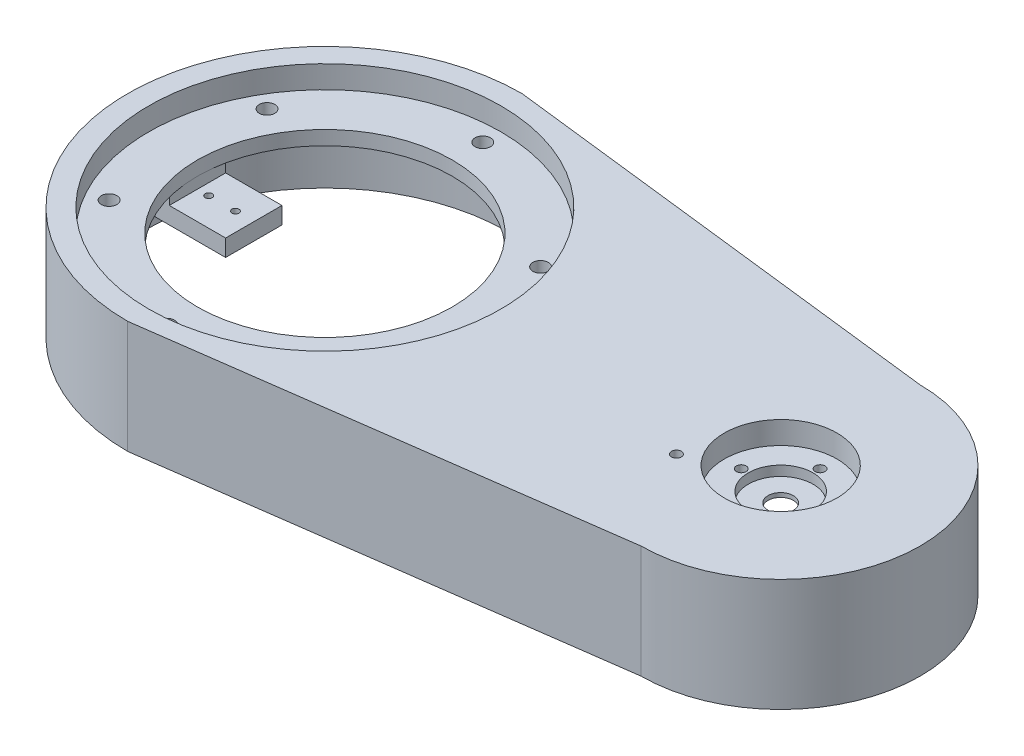
ISO-10303-21;
HEADER;
FILE_DESCRIPTION(('STEP AP214'),'2;1');
FILE_NAME('part.step','',(''),(''),'','','');
FILE_SCHEMA(('AUTOMOTIVE_DESIGN { 1 0 10303 214 1 1 1 1 }'));
ENDSEC;
DATA;
#1=APPLICATION_CONTEXT('core data for automotive mechanical design processes');
#2=APPLICATION_PROTOCOL_DEFINITION('international standard','automotive_design',2000,#1);
#3=PRODUCT_CONTEXT('',#1,'mechanical');
#4=PRODUCT('Part','Part','',(#3));
#5=PRODUCT_RELATED_PRODUCT_CATEGORY('part','',(#4));
#6=PRODUCT_DEFINITION_FORMATION('','',#4);
#7=PRODUCT_DEFINITION_CONTEXT('part definition',#1,'design');
#8=PRODUCT_DEFINITION('design','',#6,#7);
#9=PRODUCT_DEFINITION_SHAPE('','',#8);
#10=(LENGTH_UNIT() NAMED_UNIT(*) SI_UNIT(.MILLI.,.METRE.));
#11=(NAMED_UNIT(*) PLANE_ANGLE_UNIT() SI_UNIT($,.RADIAN.));
#12=(NAMED_UNIT(*) SI_UNIT($,.STERADIAN.) SOLID_ANGLE_UNIT());
#13=UNCERTAINTY_MEASURE_WITH_UNIT(LENGTH_MEASURE(1.E-05),#10,'distance_accuracy_value','');
#14=(GEOMETRIC_REPRESENTATION_CONTEXT(3) GLOBAL_UNCERTAINTY_ASSIGNED_CONTEXT((#13)) GLOBAL_UNIT_ASSIGNED_CONTEXT((#10,
#11,#12)) REPRESENTATION_CONTEXT('',''));
#15=CARTESIAN_POINT('',(0.,0.,0.));
#16=DIRECTION('',(0.,0.,1.));
#17=DIRECTION('',(1.,0.,0.));
#18=AXIS2_PLACEMENT_3D('',#15,#16,#17);
#19=CARTESIAN_POINT('',(146.2226,17.,-1.57482663465));
#20=DIRECTION('',(0.,1.,0.));
#21=DIRECTION('',(0.,0.,1.));
#22=AXIS2_PLACEMENT_3D('',#19,#20,#21);
#23=CYLINDRICAL_SURFACE('',#22,1.74999999999998);
#24=CARTESIAN_POINT('',(146.2226,27.,-1.57482663465));
#25=DIRECTION('',(0.,-1.,0.));
#26=DIRECTION('',(0.,0.,-1.));
#27=AXIS2_PLACEMENT_3D('',#24,#25,#26);
#28=CIRCLE('',#27,1.74999999999998);
#29=CARTESIAN_POINT('',(146.2226,27.,-3.32482663464998));
#30=VERTEX_POINT('',#29);
#31=EDGE_CURVE('E391',#30,#30,#28,.T.);
#32=ORIENTED_EDGE('',*,*,#31,.T.);
#33=EDGE_LOOP('',(#32));
#34=FACE_BOUND('',#33,.T.);
#35=CARTESIAN_POINT('',(146.2226,32.,-1.57482663465));
#36=DIRECTION('',(0.,1.,0.));
#37=DIRECTION('',(0.,0.,1.));
#38=AXIS2_PLACEMENT_3D('',#35,#36,#37);
#39=CIRCLE('',#38,1.74999999999998);
#40=CARTESIAN_POINT('',(146.2226,32.,0.175173365349983));
#41=VERTEX_POINT('',#40);
#42=EDGE_CURVE('E429',#41,#41,#39,.T.);
#43=ORIENTED_EDGE('',*,*,#42,.T.);
#44=EDGE_LOOP('',(#43));
#45=FACE_BOUND('',#44,.T.);
#46=ADVANCED_FACE('F49',(#34,#45),#23,.F.);
#47=CARTESIAN_POINT('',(160.2226,17.,-15.57482663465));
#48=DIRECTION('',(0.,1.,0.));
#49=DIRECTION('',(0.,0.,1.));
#50=AXIS2_PLACEMENT_3D('',#47,#48,#49);
#51=CYLINDRICAL_SURFACE('',#50,1.74999999999998);
#52=CARTESIAN_POINT('',(160.2226,27.,-15.57482663465));
#53=DIRECTION('',(0.,-1.,0.));
#54=DIRECTION('',(0.,0.,-1.));
#55=AXIS2_PLACEMENT_3D('',#52,#53,#54);
#56=CIRCLE('',#55,1.74999999999998);
#57=CARTESIAN_POINT('',(160.2226,27.,-17.32482663465));
#58=VERTEX_POINT('',#57);
#59=EDGE_CURVE('E395',#58,#58,#56,.T.);
#60=ORIENTED_EDGE('',*,*,#59,.T.);
#61=EDGE_LOOP('',(#60));
#62=FACE_BOUND('',#61,.T.);
#63=CARTESIAN_POINT('',(160.2226,32.,-15.57482663465));
#64=DIRECTION('',(0.,1.,0.));
#65=DIRECTION('',(0.,0.,1.));
#66=AXIS2_PLACEMENT_3D('',#63,#64,#65);
#67=CIRCLE('',#66,1.74999999999998);
#68=CARTESIAN_POINT('',(160.2226,32.,-13.82482663465));
#69=VERTEX_POINT('',#68);
#70=EDGE_CURVE('E423',#69,#69,#67,.T.);
#71=ORIENTED_EDGE('',*,*,#70,.T.);
#72=EDGE_LOOP('',(#71));
#73=FACE_BOUND('',#72,.T.);
#74=ADVANCED_FACE('F496',(#62,#73),#51,.F.);
#75=CARTESIAN_POINT('',(174.2226,17.,-1.57482663465));
#76=DIRECTION('',(0.,1.,0.));
#77=DIRECTION('',(0.,0.,1.));
#78=AXIS2_PLACEMENT_3D('',#75,#76,#77);
#79=CYLINDRICAL_SURFACE('',#78,1.74999999999998);
#80=CARTESIAN_POINT('',(174.2226,27.,-1.57482663465));
#81=DIRECTION('',(0.,-1.,0.));
#82=DIRECTION('',(0.,0.,-1.));
#83=AXIS2_PLACEMENT_3D('',#80,#81,#82);
#84=CIRCLE('',#83,1.74999999999998);
#85=CARTESIAN_POINT('',(174.2226,27.,-3.32482663464998));
#86=VERTEX_POINT('',#85);
#87=EDGE_CURVE('E399',#86,#86,#84,.T.);
#88=ORIENTED_EDGE('',*,*,#87,.T.);
#89=EDGE_LOOP('',(#88));
#90=FACE_BOUND('',#89,.T.);
#91=CARTESIAN_POINT('',(174.2226,32.,-1.57482663465));
#92=DIRECTION('',(0.,1.,0.));
#93=DIRECTION('',(0.,0.,1.));
#94=AXIS2_PLACEMENT_3D('',#91,#92,#93);
#95=CIRCLE('',#94,1.74999999999998);
#96=CARTESIAN_POINT('',(174.2226,32.,0.175173365349983));
#97=VERTEX_POINT('',#96);
#98=EDGE_CURVE('E436',#97,#97,#95,.T.);
#99=ORIENTED_EDGE('',*,*,#98,.T.);
#100=EDGE_LOOP('',(#99));
#101=FACE_BOUND('',#100,.T.);
#102=ADVANCED_FACE('F502',(#90,#101),#79,.F.);
#103=CARTESIAN_POINT('',(160.2226,17.,12.42517336535));
#104=DIRECTION('',(0.,1.,0.));
#105=DIRECTION('',(0.,0.,1.));
#106=AXIS2_PLACEMENT_3D('',#103,#104,#105);
#107=CYLINDRICAL_SURFACE('',#106,1.74999999999998);
#108=CARTESIAN_POINT('',(160.2226,27.,12.42517336535));
#109=DIRECTION('',(0.,-1.,0.));
#110=DIRECTION('',(0.,0.,-1.));
#111=AXIS2_PLACEMENT_3D('',#108,#109,#110);
#112=CIRCLE('',#111,1.74999999999998);
#113=CARTESIAN_POINT('',(160.2226,27.,10.67517336535));
#114=VERTEX_POINT('',#113);
#115=EDGE_CURVE('E260',#114,#114,#112,.T.);
#116=ORIENTED_EDGE('',*,*,#115,.T.);
#117=EDGE_LOOP('',(#116));
#118=FACE_BOUND('',#117,.T.);
#119=CARTESIAN_POINT('',(160.2226,32.,12.42517336535));
#120=DIRECTION('',(0.,1.,0.));
#121=DIRECTION('',(0.,0.,1.));
#122=AXIS2_PLACEMENT_3D('',#119,#120,#121);
#123=CIRCLE('',#122,1.74999999999998);
#124=CARTESIAN_POINT('',(160.2226,32.,14.17517336535));
#125=VERTEX_POINT('',#124);
#126=EDGE_CURVE('E870',#125,#125,#123,.T.);
#127=ORIENTED_EDGE('',*,*,#126,.T.);
#128=EDGE_LOOP('',(#127));
#129=FACE_BOUND('',#128,.T.);
#130=ADVANCED_FACE('F508',(#118,#129),#107,.F.);
#131=CARTESIAN_POINT('',(160.2226,28.5,-1.57482663465));
#132=DIRECTION('',(0.,1.,0.));
#133=DIRECTION('',(0.,0.,1.));
#134=AXIS2_PLACEMENT_3D('',#131,#132,#133);
#135=CYLINDRICAL_SURFACE('',#134,11.5);
#136=CARTESIAN_POINT('',(160.2226,28.5,-1.57482663465));
#137=DIRECTION('',(0.,1.,0.));
#138=DIRECTION('',(0.,0.,1.));
#139=AXIS2_PLACEMENT_3D('',#136,#137,#138);
#140=CIRCLE('',#139,11.5);
#141=CARTESIAN_POINT('',(160.2226,28.5,9.92517336534998));
#142=VERTEX_POINT('',#141);
#143=EDGE_CURVE('E234',#142,#142,#140,.T.);
#144=ORIENTED_EDGE('',*,*,#143,.F.);
#145=EDGE_LOOP('',(#144));
#146=FACE_BOUND('',#145,.T.);
#147=CARTESIAN_POINT('',(160.2226,32.,-1.57482663465));
#148=DIRECTION('',(0.,1.,0.));
#149=DIRECTION('',(0.,0.,1.));
#150=AXIS2_PLACEMENT_3D('',#147,#148,#149);
#151=CIRCLE('',#150,11.5);
#152=CARTESIAN_POINT('',(160.2226,32.,9.92517336534998));
#153=VERTEX_POINT('',#152);
#154=EDGE_CURVE('E413',#153,#153,#151,.F.);
#155=ORIENTED_EDGE('',*,*,#154,.F.);
#156=EDGE_LOOP('',(#155));
#157=FACE_BOUND('',#156,.T.);
#158=ADVANCED_FACE('F511',(#146,#157),#135,.F.);
#159=CARTESIAN_POINT('',(-45.22,17.,0.));
#160=DIRECTION('',(-1.,0.,0.));
#161=DIRECTION('',(0.,0.,1.));
#162=AXIS2_PLACEMENT_3D('',#159,#160,#161);
#163=PLANE('',#162);
#164=DIRECTION('',(0.,0.,1.));
#165=VECTOR('',#164,1.);
#166=CARTESIAN_POINT('',(-45.22,23.,10.));
#167=LINE('',#166,#165);
#168=CARTESIAN_POINT('',(-45.22,23.,-10.));
#169=VERTEX_POINT('',#168);
#170=CARTESIAN_POINT('',(-45.22,23.,10.));
#171=VERTEX_POINT('',#170);
#172=EDGE_CURVE('E186',#169,#171,#167,.T.);
#173=ORIENTED_EDGE('',*,*,#172,.F.);
#174=DIRECTION('',(0.,1.,0.));
#175=VECTOR('',#174,1.);
#176=CARTESIAN_POINT('',(-45.22,17.,-10.));
#177=LINE('',#176,#175);
#178=CARTESIAN_POINT('',(-45.22,27.,-10.));
#179=VERTEX_POINT('',#178);
#180=EDGE_CURVE('E210',#169,#179,#177,.T.);
#181=ORIENTED_EDGE('',*,*,#180,.T.);
#182=DIRECTION('',(0.,0.,1.));
#183=VECTOR('',#182,1.);
#184=CARTESIAN_POINT('',(-45.22,27.,0.));
#185=LINE('',#184,#183);
#186=CARTESIAN_POINT('',(-45.22,27.,0.));
#187=VERTEX_POINT('',#186);
#188=EDGE_CURVE('E204',#179,#187,#185,.T.);
#189=ORIENTED_EDGE('',*,*,#188,.T.);
#190=DIRECTION('',(0.,0.,-1.));
#191=VECTOR('',#190,1.);
#192=CARTESIAN_POINT('',(-45.22,27.,0.));
#193=LINE('',#192,#191);
#194=CARTESIAN_POINT('',(-45.22,27.,10.));
#195=VERTEX_POINT('',#194);
#196=EDGE_CURVE('E11',#195,#187,#193,.T.);
#197=ORIENTED_EDGE('',*,*,#196,.F.);
#198=DIRECTION('',(0.,1.,0.));
#199=VECTOR('',#198,1.);
#200=CARTESIAN_POINT('',(-45.22,17.,10.));
#201=LINE('',#200,#199);
#202=EDGE_CURVE('E227',#171,#195,#201,.T.);
#203=ORIENTED_EDGE('',*,*,#202,.F.);
#204=EDGE_LOOP('',(#173,#181,#189,#197,#203));
#205=FACE_BOUND('',#204,.T.);
#206=ADVANCED_FACE('F467',(#205),#163,.F.);
#207=CARTESIAN_POINT('',(0.,27.,0.));
#208=DIRECTION('',(0.,-1.,0.));
#209=DIRECTION('',(0.,0.,-1.));
#210=AXIS2_PLACEMENT_3D('',#207,#208,#209);
#211=PLANE('',#210);
#212=CARTESIAN_POINT('',(138.2226,27.,13.42517336535));
#213=DIRECTION('',(0.,-1.,0.));
#214=DIRECTION('',(0.,0.,-1.));
#215=AXIS2_PLACEMENT_3D('',#212,#213,#214);
#216=CIRCLE('',#215,1.75000000000001);
#217=CARTESIAN_POINT('',(138.2226,27.,11.67517336535));
#218=VERTEX_POINT('',#217);
#219=EDGE_CURVE('E862',#218,#218,#216,.T.);
#220=ORIENTED_EDGE('',*,*,#219,.F.);
#221=EDGE_LOOP('',(#220));
#222=FACE_BOUND('',#221,.T.);
#223=ORIENTED_EDGE('',*,*,#115,.F.);
#224=EDGE_LOOP('',(#223));
#225=FACE_BOUND('',#224,.T.);
#226=ORIENTED_EDGE('',*,*,#87,.F.);
#227=EDGE_LOOP('',(#226));
#228=FACE_BOUND('',#227,.T.);
#229=ORIENTED_EDGE('',*,*,#59,.F.);
#230=EDGE_LOOP('',(#229));
#231=FACE_BOUND('',#230,.T.);
#232=ORIENTED_EDGE('',*,*,#31,.F.);
#233=EDGE_LOOP('',(#232));
#234=FACE_BOUND('',#233,.T.);
#235=CARTESIAN_POINT('',(160.2226,27.,-1.57482663465));
#236=DIRECTION('',(0.,-1.,0.));
#237=DIRECTION('',(0.,0.,-1.));
#238=AXIS2_PLACEMENT_3D('',#235,#236,#237);
#239=CIRCLE('',#238,4.49999999999999);
#240=CARTESIAN_POINT('',(160.2226,27.,-6.07482663464999));
#241=VERTEX_POINT('',#240);
#242=EDGE_CURVE('E238',#241,#241,#239,.T.);
#243=ORIENTED_EDGE('',*,*,#242,.F.);
#244=EDGE_LOOP('',(#243));
#245=FACE_BOUND('',#244,.T.);
#246=CARTESIAN_POINT('',(0.,27.,0.));
#247=DIRECTION('',(0.,-1.,0.));
#248=DIRECTION('',(0.,0.,-1.));
#249=AXIS2_PLACEMENT_3D('',#246,#247,#248);
#250=CIRCLE('',#249,65.);
#251=CARTESIAN_POINT('',(0.,27.,65.));
#252=VERTEX_POINT('',#251);
#253=CARTESIAN_POINT('',(0.,27.,-65.));
#254=VERTEX_POINT('',#253);
#255=EDGE_CURVE('E239',#252,#254,#250,.T.);
#256=ORIENTED_EDGE('',*,*,#255,.T.);
#257=DIRECTION('',(0.993117870779702,0.,0.117119147614692));
#258=VECTOR('',#257,1.);
#259=CARTESIAN_POINT('',(160.2226,27.,-46.10482663465));
#260=LINE('',#259,#258);
#261=CARTESIAN_POINT('',(160.2226,27.,-46.10482663465));
#262=VERTEX_POINT('',#261);
#263=EDGE_CURVE('E243',#254,#262,#260,.T.);
#264=ORIENTED_EDGE('',*,*,#263,.T.);
#265=CARTESIAN_POINT('',(160.2226,27.,-1.57482663465));
#266=DIRECTION('',(0.,-1.,0.));
#267=DIRECTION('',(0.,0.,1.));
#268=AXIS2_PLACEMENT_3D('',#265,#266,#267);
#269=CIRCLE('',#268,44.53);
#270=CARTESIAN_POINT('',(160.2226,27.,42.95517336535));
#271=VERTEX_POINT('',#270);
#272=EDGE_CURVE('E248',#262,#271,#269,.T.);
#273=ORIENTED_EDGE('',*,*,#272,.T.);
#274=DIRECTION('',(-0.990666971693935,0.,0.136304626461351));
#275=VECTOR('',#274,1.);
#276=CARTESIAN_POINT('',(160.2226,27.,42.95517336535));
#277=LINE('',#276,#275);
#278=EDGE_CURVE('E252',#271,#252,#277,.T.);
#279=ORIENTED_EDGE('',*,*,#278,.T.);
#280=EDGE_LOOP('',(#256,#264,#273,#279));
#281=FACE_BOUND('',#280,.T.);
#282=CARTESIAN_POINT('',(48.5493841361553,27.,-28.0300000000006));
#283=DIRECTION('',(0.,-1.,0.));
#284=DIRECTION('',(0.,0.,-1.));
#285=AXIS2_PLACEMENT_3D('',#282,#283,#284);
#286=CIRCLE('',#285,2.75);
#287=CARTESIAN_POINT('',(48.5493841361553,27.,-30.7800000000006));
#288=VERTEX_POINT('',#287);
#289=EDGE_CURVE('E274',#288,#288,#286,.F.);
#290=ORIENTED_EDGE('',*,*,#289,.T.);
#291=EDGE_LOOP('',(#290));
#292=FACE_BOUND('',#291,.T.);
#293=CARTESIAN_POINT('',(0.,27.,-56.06));
#294=DIRECTION('',(0.,-1.,0.));
#295=DIRECTION('',(0.,0.,-1.));
#296=AXIS2_PLACEMENT_3D('',#293,#294,#295);
#297=CIRCLE('',#296,2.75);
#298=CARTESIAN_POINT('',(0.,27.,-58.81));
#299=VERTEX_POINT('',#298);
#300=EDGE_CURVE('E287',#299,#299,#297,.F.);
#301=ORIENTED_EDGE('',*,*,#300,.T.);
#302=EDGE_LOOP('',(#301));
#303=FACE_BOUND('',#302,.T.);
#304=CARTESIAN_POINT('',(-48.5493841361557,27.,-28.0299999999999));
#305=DIRECTION('',(0.,-1.,0.));
#306=DIRECTION('',(0.,0.,-1.));
#307=AXIS2_PLACEMENT_3D('',#304,#305,#306);
#308=CIRCLE('',#307,2.75);
#309=CARTESIAN_POINT('',(-48.5493841361557,27.,-30.7799999999999));
#310=VERTEX_POINT('',#309);
#311=EDGE_CURVE('E291',#310,#310,#308,.F.);
#312=ORIENTED_EDGE('',*,*,#311,.T.);
#313=EDGE_LOOP('',(#312));
#314=FACE_BOUND('',#313,.T.);
#315=CARTESIAN_POINT('',(-48.5493841361555,27.,28.0300000000002));
#316=DIRECTION('',(0.,-1.,0.));
#317=DIRECTION('',(0.,0.,-1.));
#318=AXIS2_PLACEMENT_3D('',#315,#316,#317);
#319=CIRCLE('',#318,2.75);
#320=CARTESIAN_POINT('',(-48.5493841361555,27.,25.2800000000002));
#321=VERTEX_POINT('',#320);
#322=EDGE_CURVE('E295',#321,#321,#319,.F.);
#323=ORIENTED_EDGE('',*,*,#322,.T.);
#324=EDGE_LOOP('',(#323));
#325=FACE_BOUND('',#324,.T.);
#326=CARTESIAN_POINT('',(3.91464887711092E-13,27.,56.06));
#327=DIRECTION('',(0.,-1.,0.));
#328=DIRECTION('',(0.,0.,-1.));
#329=AXIS2_PLACEMENT_3D('',#326,#327,#328);
#330=CIRCLE('',#329,2.75);
#331=CARTESIAN_POINT('',(3.91464887711092E-13,27.,53.31));
#332=VERTEX_POINT('',#331);
#333=EDGE_CURVE('E299',#332,#332,#330,.F.);
#334=ORIENTED_EDGE('',*,*,#333,.T.);
#335=EDGE_LOOP('',(#334));
#336=FACE_BOUND('',#335,.T.);
#337=CARTESIAN_POINT('',(48.5493841361559,27.,28.0299999999995));
#338=DIRECTION('',(0.,-1.,0.));
#339=DIRECTION('',(0.,0.,-1.));
#340=AXIS2_PLACEMENT_3D('',#337,#338,#339);
#341=CIRCLE('',#340,2.75);
#342=CARTESIAN_POINT('',(48.5493841361559,27.,25.2799999999995));
#343=VERTEX_POINT('',#342);
#344=EDGE_CURVE('E303',#343,#343,#341,.F.);
#345=ORIENTED_EDGE('',*,*,#344,.T.);
#346=EDGE_LOOP('',(#345));
#347=FACE_BOUND('',#346,.T.);
#348=DIRECTION('',(-1.,0.,0.));
#349=VECTOR('',#348,1.);
#350=CARTESIAN_POINT('',(-45.22,27.,10.));
#351=LINE('',#350,#349);
#352=CARTESIAN_POINT('',(-50.22,27.,10.));
#353=VERTEX_POINT('',#352);
#354=EDGE_CURVE('E213',#195,#353,#351,.T.);
#355=ORIENTED_EDGE('',*,*,#354,.F.);
#356=ORIENTED_EDGE('',*,*,#196,.T.);
#357=CARTESIAN_POINT('',(0.,27.,0.));
#358=DIRECTION('',(0.,-1.,0.));
#359=DIRECTION('',(0.,0.,-1.));
#360=AXIS2_PLACEMENT_3D('',#357,#358,#359);
#361=CIRCLE('',#360,45.22);
#362=EDGE_CURVE('E283',#187,#187,#361,.F.);
#363=ORIENTED_EDGE('',*,*,#362,.T.);
#364=ORIENTED_EDGE('',*,*,#188,.F.);
#365=DIRECTION('',(1.,0.,0.));
#366=VECTOR('',#365,1.);
#367=CARTESIAN_POINT('',(-50.22,27.,-10.));
#368=LINE('',#367,#366);
#369=CARTESIAN_POINT('',(-50.22,27.,-10.));
#370=VERTEX_POINT('',#369);
#371=EDGE_CURVE('E170',#370,#179,#368,.T.);
#372=ORIENTED_EDGE('',*,*,#371,.F.);
#373=DIRECTION('',(0.,0.,-1.));
#374=VECTOR('',#373,1.);
#375=CARTESIAN_POINT('',(-50.22,27.,10.));
#376=LINE('',#375,#374);
#377=EDGE_CURVE('E216',#353,#370,#376,.T.);
#378=ORIENTED_EDGE('',*,*,#377,.F.);
#379=EDGE_LOOP('',(#355,#356,#363,#364,#372,#378));
#380=FACE_BOUND('',#379,.T.);
#381=ADVANCED_FACE('F472',(#222,#225,#228,#231,#234,#245,#281,#292,#303,#314,#325,#336,#347,
#380),#211,.T.);
#382=CARTESIAN_POINT('',(160.2226,17.,-1.57482663465));
#383=DIRECTION('',(0.,1.,0.));
#384=DIRECTION('',(0.,0.,1.));
#385=AXIS2_PLACEMENT_3D('',#382,#383,#384);
#386=CYLINDRICAL_SURFACE('',#385,4.49999999999999);
#387=ORIENTED_EDGE('',*,*,#242,.T.);
#388=EDGE_LOOP('',(#387));
#389=FACE_BOUND('',#388,.T.);
#390=CARTESIAN_POINT('',(160.2226,28.5,-1.57482663465));
#391=DIRECTION('',(0.,1.,0.));
#392=DIRECTION('',(0.,0.,1.));
#393=AXIS2_PLACEMENT_3D('',#390,#391,#392);
#394=CIRCLE('',#393,4.49999999999999);
#395=CARTESIAN_POINT('',(160.2226,28.5,2.92517336534999));
#396=VERTEX_POINT('',#395);
#397=EDGE_CURVE('E230',#396,#396,#394,.T.);
#398=ORIENTED_EDGE('',*,*,#397,.T.);
#399=EDGE_LOOP('',(#398));
#400=FACE_BOUND('',#399,.T.);
#401=ADVANCED_FACE('F516',(#389,#400),#386,.F.);
#402=CARTESIAN_POINT('',(48.5493841361559,12.,28.0299999999995));
#403=DIRECTION('',(0.,1.,0.));
#404=DIRECTION('',(0.,0.,1.));
#405=AXIS2_PLACEMENT_3D('',#402,#403,#404);
#406=CYLINDRICAL_SURFACE('',#405,2.75);
#407=CARTESIAN_POINT('',(48.5493841361559,32.,28.0299999999995));
#408=DIRECTION('',(0.,1.,0.));
#409=DIRECTION('',(0.,0.,1.));
#410=AXIS2_PLACEMENT_3D('',#407,#408,#409);
#411=CIRCLE('',#410,2.75);
#412=CARTESIAN_POINT('',(48.5493841361559,32.,30.7799999999995));
#413=VERTEX_POINT('',#412);
#414=EDGE_CURVE('E316',#413,#413,#411,.F.);
#415=ORIENTED_EDGE('',*,*,#414,.F.);
#416=EDGE_LOOP('',(#415));
#417=FACE_BOUND('',#416,.T.);
#418=ORIENTED_EDGE('',*,*,#344,.F.);
#419=EDGE_LOOP('',(#418));
#420=FACE_BOUND('',#419,.T.);
#421=ADVANCED_FACE('F519',(#417,#420),#406,.F.);
#422=CARTESIAN_POINT('',(3.91464887711092E-13,12.,56.06));
#423=DIRECTION('',(0.,1.,0.));
#424=DIRECTION('',(0.,0.,1.));
#425=AXIS2_PLACEMENT_3D('',#422,#423,#424);
#426=CYLINDRICAL_SURFACE('',#425,2.75);
#427=CARTESIAN_POINT('',(3.91464887711092E-13,32.,56.06));
#428=DIRECTION('',(0.,1.,0.));
#429=DIRECTION('',(0.,0.,1.));
#430=AXIS2_PLACEMENT_3D('',#427,#428,#429);
#431=CIRCLE('',#430,2.75);
#432=CARTESIAN_POINT('',(3.91464887711092E-13,32.,58.81));
#433=VERTEX_POINT('',#432);
#434=EDGE_CURVE('E320',#433,#433,#431,.F.);
#435=ORIENTED_EDGE('',*,*,#434,.F.);
#436=EDGE_LOOP('',(#435));
#437=FACE_BOUND('',#436,.T.);
#438=ORIENTED_EDGE('',*,*,#333,.F.);
#439=EDGE_LOOP('',(#438));
#440=FACE_BOUND('',#439,.T.);
#441=ADVANCED_FACE('F555',(#437,#440),#426,.F.);
#442=CARTESIAN_POINT('',(-48.5493841361555,12.,28.0300000000002));
#443=DIRECTION('',(0.,1.,0.));
#444=DIRECTION('',(0.,0.,1.));
#445=AXIS2_PLACEMENT_3D('',#442,#443,#444);
#446=CYLINDRICAL_SURFACE('',#445,2.75);
#447=CARTESIAN_POINT('',(-48.5493841361555,32.,28.0300000000002));
#448=DIRECTION('',(0.,1.,0.));
#449=DIRECTION('',(0.,0.,1.));
#450=AXIS2_PLACEMENT_3D('',#447,#448,#449);
#451=CIRCLE('',#450,2.75);
#452=CARTESIAN_POINT('',(-48.5493841361555,32.,30.7800000000002));
#453=VERTEX_POINT('',#452);
#454=EDGE_CURVE('E324',#453,#453,#451,.F.);
#455=ORIENTED_EDGE('',*,*,#454,.F.);
#456=EDGE_LOOP('',(#455));
#457=FACE_BOUND('',#456,.T.);
#458=ORIENTED_EDGE('',*,*,#322,.F.);
#459=EDGE_LOOP('',(#458));
#460=FACE_BOUND('',#459,.T.);
#461=ADVANCED_FACE('F551',(#457,#460),#446,.F.);
#462=CARTESIAN_POINT('',(-48.5493841361557,12.,-28.0299999999999));
#463=DIRECTION('',(0.,1.,0.));
#464=DIRECTION('',(0.,0.,1.));
#465=AXIS2_PLACEMENT_3D('',#462,#463,#464);
#466=CYLINDRICAL_SURFACE('',#465,2.75);
#467=CARTESIAN_POINT('',(-48.5493841361557,32.,-28.0299999999999));
#468=DIRECTION('',(0.,1.,0.));
#469=DIRECTION('',(0.,0.,1.));
#470=AXIS2_PLACEMENT_3D('',#467,#468,#469);
#471=CIRCLE('',#470,2.75);
#472=CARTESIAN_POINT('',(-48.5493841361557,32.,-25.2799999999999));
#473=VERTEX_POINT('',#472);
#474=EDGE_CURVE('E328',#473,#473,#471,.F.);
#475=ORIENTED_EDGE('',*,*,#474,.F.);
#476=EDGE_LOOP('',(#475));
#477=FACE_BOUND('',#476,.T.);
#478=ORIENTED_EDGE('',*,*,#311,.F.);
#479=EDGE_LOOP('',(#478));
#480=FACE_BOUND('',#479,.T.);
#481=ADVANCED_FACE('F490',(#477,#480),#466,.F.);
#482=CARTESIAN_POINT('',(0.,12.,-56.06));
#483=DIRECTION('',(0.,1.,0.));
#484=DIRECTION('',(0.,0.,1.));
#485=AXIS2_PLACEMENT_3D('',#482,#483,#484);
#486=CYLINDRICAL_SURFACE('',#485,2.75);
#487=CARTESIAN_POINT('',(0.,32.,-56.06));
#488=DIRECTION('',(0.,1.,0.));
#489=DIRECTION('',(0.,0.,1.));
#490=AXIS2_PLACEMENT_3D('',#487,#488,#489);
#491=CIRCLE('',#490,2.75);
#492=CARTESIAN_POINT('',(0.,32.,-53.31));
#493=VERTEX_POINT('',#492);
#494=EDGE_CURVE('E332',#493,#493,#491,.F.);
#495=ORIENTED_EDGE('',*,*,#494,.F.);
#496=EDGE_LOOP('',(#495));
#497=FACE_BOUND('',#496,.T.);
#498=ORIENTED_EDGE('',*,*,#300,.F.);
#499=EDGE_LOOP('',(#498));
#500=FACE_BOUND('',#499,.T.);
#501=ADVANCED_FACE('F481',(#497,#500),#486,.F.);
#502=CARTESIAN_POINT('',(0.,12.,0.));
#503=DIRECTION('',(0.,1.,0.));
#504=DIRECTION('',(0.,0.,1.));
#505=AXIS2_PLACEMENT_3D('',#502,#503,#504);
#506=CYLINDRICAL_SURFACE('',#505,45.22);
#507=CARTESIAN_POINT('',(0.,32.,0.));
#508=DIRECTION('',(0.,1.,0.));
#509=DIRECTION('',(0.,0.,1.));
#510=AXIS2_PLACEMENT_3D('',#507,#508,#509);
#511=CIRCLE('',#510,45.22);
#512=CARTESIAN_POINT('',(0.,32.,45.22));
#513=VERTEX_POINT('',#512);
#514=EDGE_CURVE('E336',#513,#513,#511,.F.);
#515=ORIENTED_EDGE('',*,*,#514,.F.);
#516=EDGE_LOOP('',(#515));
#517=FACE_BOUND('',#516,.T.);
#518=ORIENTED_EDGE('',*,*,#362,.F.);
#519=EDGE_LOOP('',(#518));
#520=FACE_BOUND('',#519,.T.);
#521=ADVANCED_FACE('F478',(#517,#520),#506,.F.);
#522=CARTESIAN_POINT('',(48.5493841361553,12.,-28.0300000000006));
#523=DIRECTION('',(0.,1.,0.));
#524=DIRECTION('',(0.,0.,1.));
#525=AXIS2_PLACEMENT_3D('',#522,#523,#524);
#526=CYLINDRICAL_SURFACE('',#525,2.75);
#527=CARTESIAN_POINT('',(48.5493841361553,32.,-28.0300000000006));
#528=DIRECTION('',(0.,1.,0.));
#529=DIRECTION('',(0.,0.,1.));
#530=AXIS2_PLACEMENT_3D('',#527,#528,#529);
#531=CIRCLE('',#530,2.75);
#532=CARTESIAN_POINT('',(48.5493841361553,32.,-25.2800000000006));
#533=VERTEX_POINT('',#532);
#534=EDGE_CURVE('E312',#533,#533,#531,.F.);
#535=ORIENTED_EDGE('',*,*,#534,.F.);
#536=EDGE_LOOP('',(#535));
#537=FACE_BOUND('',#536,.T.);
#538=ORIENTED_EDGE('',*,*,#289,.F.);
#539=EDGE_LOOP('',(#538));
#540=FACE_BOUND('',#539,.T.);
#541=ADVANCED_FACE('F480',(#537,#540),#526,.F.);
#542=CARTESIAN_POINT('',(160.2226,40.,-1.57482663465));
#543=DIRECTION('',(0.,-1.,0.));
#544=DIRECTION('',(0.,0.,-1.));
#545=AXIS2_PLACEMENT_3D('',#542,#543,#544);
#546=CYLINDRICAL_SURFACE('',#545,49.52725374955);
#547=CARTESIAN_POINT('',(160.2226,0.,-1.57482663465));
#548=DIRECTION('',(0.,1.,0.));
#549=DIRECTION('',(0.,0.,1.));
#550=AXIS2_PLACEMENT_3D('',#547,#548,#549);
#551=CIRCLE('',#550,49.52725374955);
#552=CARTESIAN_POINT('',(160.2226,0.,47.9524271149));
#553=VERTEX_POINT('',#552);
#554=CARTESIAN_POINT('',(160.2226,0.,-51.1020803842));
#555=VERTEX_POINT('',#554);
#556=EDGE_CURVE('E340',#553,#555,#551,.T.);
#557=ORIENTED_EDGE('',*,*,#556,.T.);
#558=DIRECTION('',(0.,-1.,0.));
#559=VECTOR('',#558,1.);
#560=CARTESIAN_POINT('',(160.2226,40.,-51.1020803842));
#561=LINE('',#560,#559);
#562=CARTESIAN_POINT('',(160.2226,40.,-51.1020803842));
#563=VERTEX_POINT('',#562);
#564=EDGE_CURVE('E59',#563,#555,#561,.T.);
#565=ORIENTED_EDGE('',*,*,#564,.F.);
#566=CARTESIAN_POINT('',(160.2226,40.,-1.57482663465));
#567=DIRECTION('',(0.,1.,0.));
#568=DIRECTION('',(0.,0.,1.));
#569=AXIS2_PLACEMENT_3D('',#566,#567,#568);
#570=CIRCLE('',#569,49.52725374955);
#571=CARTESIAN_POINT('',(160.2226,40.,47.9524271149));
#572=VERTEX_POINT('',#571);
#573=EDGE_CURVE('E341',#572,#563,#570,.T.);
#574=ORIENTED_EDGE('',*,*,#573,.F.);
#575=DIRECTION('',(0.,-1.,0.));
#576=VECTOR('',#575,1.);
#577=CARTESIAN_POINT('',(160.2226,40.,47.9524271149));
#578=LINE('',#577,#576);
#579=EDGE_CURVE('E357',#572,#553,#578,.T.);
#580=ORIENTED_EDGE('',*,*,#579,.T.);
#581=EDGE_LOOP('',(#557,#565,#574,#580));
#582=FACE_BOUND('',#581,.T.);
#583=ADVANCED_FACE('F51',(#582),#546,.T.);
#584=CARTESIAN_POINT('',(0.,40.,-70.));
#585=DIRECTION('',(0.117135936329746,0.,-0.993115890729855));
#586=DIRECTION('',(-0.993115890729855,0.,-0.117135936329746));
#587=AXIS2_PLACEMENT_3D('',#584,#585,#586);
#588=PLANE('',#587);
#589=DIRECTION('',(0.993115890729855,0.,0.117135936329746));
#590=VECTOR('',#589,1.);
#591=CARTESIAN_POINT('',(0.,0.,-70.));
#592=LINE('',#591,#590);
#593=CARTESIAN_POINT('',(0.,0.,-70.));
#594=VERTEX_POINT('',#593);
#595=EDGE_CURVE('E361',#594,#555,#592,.T.);
#596=ORIENTED_EDGE('',*,*,#595,.F.);
#597=DIRECTION('',(0.,-1.,0.));
#598=VECTOR('',#597,1.);
#599=CARTESIAN_POINT('',(0.,40.,-70.));
#600=LINE('',#599,#598);
#601=CARTESIAN_POINT('',(0.,40.,-70.));
#602=VERTEX_POINT('',#601);
#603=EDGE_CURVE('E377',#602,#594,#600,.T.);
#604=ORIENTED_EDGE('',*,*,#603,.F.);
#605=DIRECTION('',(0.993115890729855,0.,0.117135936329746));
#606=VECTOR('',#605,1.);
#607=CARTESIAN_POINT('',(0.,40.,-70.));
#608=LINE('',#607,#606);
#609=EDGE_CURVE('E344',#602,#563,#608,.T.);
#610=ORIENTED_EDGE('',*,*,#609,.T.);
#611=ORIENTED_EDGE('',*,*,#564,.T.);
#612=EDGE_LOOP('',(#596,#604,#610,#611));
#613=FACE_BOUND('',#612,.T.);
#614=ADVANCED_FACE('F919',(#613),#588,.T.);
#615=CARTESIAN_POINT('',(0.,40.,0.));
#616=DIRECTION('',(0.,-1.,0.));
#617=DIRECTION('',(0.,0.,-1.));
#618=AXIS2_PLACEMENT_3D('',#615,#616,#617);
#619=CYLINDRICAL_SURFACE('',#618,70.);
#620=CARTESIAN_POINT('',(0.,0.,0.));
#621=DIRECTION('',(0.,-1.,0.));
#622=DIRECTION('',(0.,0.,-1.));
#623=AXIS2_PLACEMENT_3D('',#620,#621,#622);
#624=CIRCLE('',#623,70.);
#625=CARTESIAN_POINT('',(0.,0.,70.));
#626=VERTEX_POINT('',#625);
#627=EDGE_CURVE('E365',#626,#594,#624,.T.);
#628=ORIENTED_EDGE('',*,*,#627,.F.);
#629=DIRECTION('',(0.,-1.,0.));
#630=VECTOR('',#629,1.);
#631=CARTESIAN_POINT('',(0.,40.,70.));
#632=LINE('',#631,#630);
#633=CARTESIAN_POINT('',(0.,40.,70.));
#634=VERTEX_POINT('',#633);
#635=EDGE_CURVE('E374',#634,#626,#632,.T.);
#636=ORIENTED_EDGE('',*,*,#635,.F.);
#637=CARTESIAN_POINT('',(0.,40.,0.));
#638=DIRECTION('',(0.,-1.,0.));
#639=DIRECTION('',(0.,0.,-1.));
#640=AXIS2_PLACEMENT_3D('',#637,#638,#639);
#641=CIRCLE('',#640,70.);
#642=EDGE_CURVE('E349',#634,#602,#641,.T.);
#643=ORIENTED_EDGE('',*,*,#642,.T.);
#644=ORIENTED_EDGE('',*,*,#603,.T.);
#645=EDGE_LOOP('',(#628,#636,#643,#644));
#646=FACE_BOUND('',#645,.T.);
#647=ADVANCED_FACE('F916',(#646),#619,.T.);
#648=CARTESIAN_POINT('',(160.2226,40.,47.9524271149));
#649=DIRECTION('',(0.136321291177113,0.,0.990664678673771));
#650=DIRECTION('',(0.990664678673771,0.,-0.136321291177113));
#651=AXIS2_PLACEMENT_3D('',#648,#649,#650);
#652=PLANE('',#651);
#653=DIRECTION('',(-0.990664678673771,0.,0.136321291177113));
#654=VECTOR('',#653,1.);
#655=CARTESIAN_POINT('',(160.2226,0.,47.9524271149));
#656=LINE('',#655,#654);
#657=EDGE_CURVE('E345',#553,#626,#656,.T.);
#658=ORIENTED_EDGE('',*,*,#657,.F.);
#659=ORIENTED_EDGE('',*,*,#579,.F.);
#660=DIRECTION('',(-0.990664678673771,0.,0.136321291177113));
#661=VECTOR('',#660,1.);
#662=CARTESIAN_POINT('',(160.2226,40.,47.9524271149));
#663=LINE('',#662,#661);
#664=EDGE_CURVE('E353',#572,#634,#663,.T.);
#665=ORIENTED_EDGE('',*,*,#664,.T.);
#666=ORIENTED_EDGE('',*,*,#635,.T.);
#667=EDGE_LOOP('',(#658,#659,#665,#666));
#668=FACE_BOUND('',#667,.T.);
#669=ADVANCED_FACE('F824',(#668),#652,.T.);
#670=CARTESIAN_POINT('',(160.2226,40.,-1.57482663465));
#671=DIRECTION('',(0.,1.,0.));
#672=DIRECTION('',(0.,0.,1.));
#673=AXIS2_PLACEMENT_3D('',#670,#671,#672);
#674=PLANE('',#673);
#675=CARTESIAN_POINT('',(138.2226,40.,13.42517336535));
#676=DIRECTION('',(0.,1.,0.));
#677=DIRECTION('',(0.,0.,1.));
#678=AXIS2_PLACEMENT_3D('',#675,#676,#677);
#679=CIRCLE('',#678,1.75000000000001);
#680=CARTESIAN_POINT('',(138.2226,40.,15.17517336535));
#681=VERTEX_POINT('',#680);
#682=EDGE_CURVE('E53',#681,#681,#679,.T.);
#683=ORIENTED_EDGE('',*,*,#682,.F.);
#684=EDGE_LOOP('',(#683));
#685=FACE_BOUND('',#684,.T.);
#686=CARTESIAN_POINT('',(160.2226,40.,-1.57482663465));
#687=DIRECTION('',(0.,1.,0.));
#688=DIRECTION('',(0.,0.,1.));
#689=AXIS2_PLACEMENT_3D('',#686,#687,#688);
#690=CIRCLE('',#689,20.);
#691=CARTESIAN_POINT('',(160.2226,40.,18.42517336535));
#692=VERTEX_POINT('',#691);
#693=EDGE_CURVE('E433',#692,#692,#690,.T.);
#694=ORIENTED_EDGE('',*,*,#693,.F.);
#695=EDGE_LOOP('',(#694));
#696=FACE_BOUND('',#695,.T.);
#697=CARTESIAN_POINT('',(0.,40.,0.));
#698=DIRECTION('',(0.,1.,0.));
#699=DIRECTION('',(0.,0.,1.));
#700=AXIS2_PLACEMENT_3D('',#697,#698,#699);
#701=CIRCLE('',#700,62.5);
#702=CARTESIAN_POINT('',(0.,40.,62.5));
#703=VERTEX_POINT('',#702);
#704=EDGE_CURVE('E307',#703,#703,#701,.T.);
#705=ORIENTED_EDGE('',*,*,#704,.F.);
#706=EDGE_LOOP('',(#705));
#707=FACE_BOUND('',#706,.T.);
#708=ORIENTED_EDGE('',*,*,#573,.T.);
#709=ORIENTED_EDGE('',*,*,#609,.F.);
#710=ORIENTED_EDGE('',*,*,#642,.F.);
#711=ORIENTED_EDGE('',*,*,#664,.F.);
#712=EDGE_LOOP('',(#708,#709,#710,#711));
#713=FACE_BOUND('',#712,.T.);
#714=ADVANCED_FACE('F629',(#685,#696,#707,#713),#674,.T.);
#715=CARTESIAN_POINT('',(160.2226,0.,-1.57482663465));
#716=DIRECTION('',(0.,1.,0.));
#717=DIRECTION('',(0.,0.,1.));
#718=AXIS2_PLACEMENT_3D('',#715,#716,#717);
#719=PLANE('',#718);
#720=DIRECTION('',(0.993117870779702,0.,0.117119147614692));
#721=VECTOR('',#720,1.);
#722=CARTESIAN_POINT('',(160.2226,0.,-46.10482663465));
#723=LINE('',#722,#721);
#724=CARTESIAN_POINT('',(0.,0.,-65.));
#725=VERTEX_POINT('',#724);
#726=CARTESIAN_POINT('',(160.2226,0.,-46.10482663465));
#727=VERTEX_POINT('',#726);
#728=EDGE_CURVE('E259',#725,#727,#723,.T.);
#729=ORIENTED_EDGE('',*,*,#728,.F.);
#730=CARTESIAN_POINT('',(0.,0.,0.));
#731=DIRECTION('',(0.,-1.,0.));
#732=DIRECTION('',(0.,0.,-1.));
#733=AXIS2_PLACEMENT_3D('',#730,#731,#732);
#734=CIRCLE('',#733,65.);
#735=CARTESIAN_POINT('',(0.,0.,65.));
#736=VERTEX_POINT('',#735);
#737=EDGE_CURVE('E75',#736,#725,#734,.T.);
#738=ORIENTED_EDGE('',*,*,#737,.F.);
#739=DIRECTION('',(-0.990666971693935,0.,0.136304626461351));
#740=VECTOR('',#739,1.);
#741=CARTESIAN_POINT('',(160.2226,0.,42.95517336535));
#742=LINE('',#741,#740);
#743=CARTESIAN_POINT('',(160.2226,0.,42.95517336535));
#744=VERTEX_POINT('',#743);
#745=EDGE_CURVE('E244',#744,#736,#742,.T.);
#746=ORIENTED_EDGE('',*,*,#745,.F.);
#747=CARTESIAN_POINT('',(160.2226,0.,-1.57482663465));
#748=DIRECTION('',(0.,-1.,0.));
#749=DIRECTION('',(0.,0.,1.));
#750=AXIS2_PLACEMENT_3D('',#747,#748,#749);
#751=CIRCLE('',#750,44.53);
#752=EDGE_CURVE('E264',#727,#744,#751,.T.);
#753=ORIENTED_EDGE('',*,*,#752,.F.);
#754=EDGE_LOOP('',(#729,#738,#746,#753));
#755=FACE_BOUND('',#754,.T.);
#756=ORIENTED_EDGE('',*,*,#556,.F.);
#757=ORIENTED_EDGE('',*,*,#657,.T.);
#758=ORIENTED_EDGE('',*,*,#627,.T.);
#759=ORIENTED_EDGE('',*,*,#595,.T.);
#760=EDGE_LOOP('',(#756,#757,#758,#759));
#761=FACE_BOUND('',#760,.T.);
#762=ADVANCED_FACE('F544',(#755,#761),#719,.F.);
#763=CARTESIAN_POINT('',(0.,32.,0.));
#764=DIRECTION('',(0.,1.,0.));
#765=DIRECTION('',(0.,0.,1.));
#766=AXIS2_PLACEMENT_3D('',#763,#764,#765);
#767=PLANE('',#766);
#768=CARTESIAN_POINT('',(0.,32.,0.));
#769=DIRECTION('',(0.,1.,0.));
#770=DIRECTION('',(0.,0.,1.));
#771=AXIS2_PLACEMENT_3D('',#768,#769,#770);
#772=CIRCLE('',#771,62.5);
#773=CARTESIAN_POINT('',(0.,32.,62.5));
#774=VERTEX_POINT('',#773);
#775=EDGE_CURVE('E308',#774,#774,#772,.T.);
#776=ORIENTED_EDGE('',*,*,#775,.T.);
#777=EDGE_LOOP('',(#776));
#778=FACE_BOUND('',#777,.T.);
#779=ORIENTED_EDGE('',*,*,#534,.T.);
#780=EDGE_LOOP('',(#779));
#781=FACE_BOUND('',#780,.T.);
#782=ORIENTED_EDGE('',*,*,#414,.T.);
#783=EDGE_LOOP('',(#782));
#784=FACE_BOUND('',#783,.T.);
#785=ORIENTED_EDGE('',*,*,#434,.T.);
#786=EDGE_LOOP('',(#785));
#787=FACE_BOUND('',#786,.T.);
#788=ORIENTED_EDGE('',*,*,#454,.T.);
#789=EDGE_LOOP('',(#788));
#790=FACE_BOUND('',#789,.T.);
#791=ORIENTED_EDGE('',*,*,#474,.T.);
#792=EDGE_LOOP('',(#791));
#793=FACE_BOUND('',#792,.T.);
#794=ORIENTED_EDGE('',*,*,#494,.T.);
#795=EDGE_LOOP('',(#794));
#796=FACE_BOUND('',#795,.T.);
#797=ORIENTED_EDGE('',*,*,#514,.T.);
#798=EDGE_LOOP('',(#797));
#799=FACE_BOUND('',#798,.T.);
#800=ADVANCED_FACE('F541',(#778,#781,#784,#787,#790,#793,#796,#799),#767,.T.);
#801=CARTESIAN_POINT('',(0.,32.,0.));
#802=DIRECTION('',(0.,1.,0.));
#803=DIRECTION('',(0.,0.,1.));
#804=AXIS2_PLACEMENT_3D('',#801,#802,#803);
#805=CYLINDRICAL_SURFACE('',#804,62.5);
#806=ORIENTED_EDGE('',*,*,#775,.F.);
#807=EDGE_LOOP('',(#806));
#808=FACE_BOUND('',#807,.T.);
#809=ORIENTED_EDGE('',*,*,#704,.T.);
#810=EDGE_LOOP('',(#809));
#811=FACE_BOUND('',#810,.T.);
#812=ADVANCED_FACE('F540',(#808,#811),#805,.F.);
#813=CARTESIAN_POINT('',(0.,27.,0.));
#814=DIRECTION('',(0.,-1.,0.));
#815=DIRECTION('',(0.,0.,-1.));
#816=AXIS2_PLACEMENT_3D('',#813,#814,#815);
#817=CYLINDRICAL_SURFACE('',#816,65.);
#818=ORIENTED_EDGE('',*,*,#737,.T.);
#819=DIRECTION('',(0.,-1.,0.));
#820=VECTOR('',#819,1.);
#821=CARTESIAN_POINT('',(0.,27.,-65.));
#822=LINE('',#821,#820);
#823=EDGE_CURVE('E256',#254,#725,#822,.T.);
#824=ORIENTED_EDGE('',*,*,#823,.F.);
#825=ORIENTED_EDGE('',*,*,#255,.F.);
#826=DIRECTION('',(0.,-1.,0.));
#827=VECTOR('',#826,1.);
#828=CARTESIAN_POINT('',(0.,27.,65.));
#829=LINE('',#828,#827);
#830=EDGE_CURVE('E271',#252,#736,#829,.T.);
#831=ORIENTED_EDGE('',*,*,#830,.T.);
#832=EDGE_LOOP('',(#818,#824,#825,#831));
#833=FACE_BOUND('',#832,.T.);
#834=ADVANCED_FACE('F528',(#833),#817,.F.);
#835=CARTESIAN_POINT('',(160.2226,27.,42.95517336535));
#836=DIRECTION('',(0.136304626461351,0.,0.990666971693935));
#837=DIRECTION('',(0.990666971693935,0.,-0.136304626461351));
#838=AXIS2_PLACEMENT_3D('',#835,#836,#837);
#839=PLANE('',#838);
#840=ORIENTED_EDGE('',*,*,#745,.T.);
#841=ORIENTED_EDGE('',*,*,#830,.F.);
#842=ORIENTED_EDGE('',*,*,#278,.F.);
#843=DIRECTION('',(0.,-1.,0.));
#844=VECTOR('',#843,1.);
#845=CARTESIAN_POINT('',(160.2226,27.,42.95517336535));
#846=LINE('',#845,#844);
#847=EDGE_CURVE('E275',#271,#744,#846,.T.);
#848=ORIENTED_EDGE('',*,*,#847,.T.);
#849=EDGE_LOOP('',(#840,#841,#842,#848));
#850=FACE_BOUND('',#849,.T.);
#851=ADVANCED_FACE('F524',(#850),#839,.F.);
#852=CARTESIAN_POINT('',(160.2226,27.,-1.57482663465));
#853=DIRECTION('',(0.,-1.,0.));
#854=DIRECTION('',(0.,0.,-1.));
#855=AXIS2_PLACEMENT_3D('',#852,#853,#854);
#856=CYLINDRICAL_SURFACE('',#855,44.53);
#857=ORIENTED_EDGE('',*,*,#752,.T.);
#858=ORIENTED_EDGE('',*,*,#847,.F.);
#859=ORIENTED_EDGE('',*,*,#272,.F.);
#860=DIRECTION('',(0.,-1.,0.));
#861=VECTOR('',#860,1.);
#862=CARTESIAN_POINT('',(160.2226,27.,-46.10482663465));
#863=LINE('',#862,#861);
#864=EDGE_CURVE('E278',#262,#727,#863,.T.);
#865=ORIENTED_EDGE('',*,*,#864,.T.);
#866=EDGE_LOOP('',(#857,#858,#859,#865));
#867=FACE_BOUND('',#866,.T.);
#868=ADVANCED_FACE('F527',(#867),#856,.F.);
#869=CARTESIAN_POINT('',(160.2226,27.,-46.10482663465));
#870=DIRECTION('',(0.117119147614692,0.,-0.993117870779702));
#871=DIRECTION('',(-0.993117870779702,0.,-0.117119147614692));
#872=AXIS2_PLACEMENT_3D('',#869,#870,#871);
#873=PLANE('',#872);
#874=ORIENTED_EDGE('',*,*,#728,.T.);
#875=ORIENTED_EDGE('',*,*,#864,.F.);
#876=ORIENTED_EDGE('',*,*,#263,.F.);
#877=ORIENTED_EDGE('',*,*,#823,.T.);
#878=EDGE_LOOP('',(#874,#875,#876,#877));
#879=FACE_BOUND('',#878,.T.);
#880=ADVANCED_FACE('F532',(#879),#873,.F.);
#881=CARTESIAN_POINT('',(0.,28.5,0.));
#882=DIRECTION('',(0.,1.,0.));
#883=DIRECTION('',(0.,0.,1.));
#884=AXIS2_PLACEMENT_3D('',#881,#882,#883);
#885=PLANE('',#884);
#886=ORIENTED_EDGE('',*,*,#397,.F.);
#887=EDGE_LOOP('',(#886));
#888=FACE_BOUND('',#887,.T.);
#889=ORIENTED_EDGE('',*,*,#143,.T.);
#890=EDGE_LOOP('',(#889));
#891=FACE_BOUND('',#890,.T.);
#892=ADVANCED_FACE('F536',(#888,#891),#885,.T.);
#893=CARTESIAN_POINT('',(-45.22,17.,10.));
#894=DIRECTION('',(0.,0.,-1.));
#895=DIRECTION('',(-1.,0.,0.));
#896=AXIS2_PLACEMENT_3D('',#893,#894,#895);
#897=PLANE('',#896);
#898=ORIENTED_EDGE('',*,*,#354,.T.);
#899=DIRECTION('',(0.,1.,0.));
#900=VECTOR('',#899,1.);
#901=CARTESIAN_POINT('',(-50.22,17.,10.));
#902=LINE('',#901,#900);
#903=CARTESIAN_POINT('',(-50.22,17.,10.));
#904=VERTEX_POINT('',#903);
#905=EDGE_CURVE('E165',#904,#353,#902,.T.);
#906=ORIENTED_EDGE('',*,*,#905,.F.);
#907=DIRECTION('',(-1.,0.,0.));
#908=VECTOR('',#907,1.);
#909=CARTESIAN_POINT('',(-45.22,17.,10.));
#910=LINE('',#909,#908);
#911=CARTESIAN_POINT('',(-25.22,17.,10.));
#912=VERTEX_POINT('',#911);
#913=EDGE_CURVE('E158',#912,#904,#910,.T.);
#914=ORIENTED_EDGE('',*,*,#913,.F.);
#915=DIRECTION('',(0.,-1.,0.));
#916=VECTOR('',#915,1.);
#917=CARTESIAN_POINT('',(-25.22,17.,10.));
#918=LINE('',#917,#916);
#919=CARTESIAN_POINT('',(-25.22,23.,10.));
#920=VERTEX_POINT('',#919);
#921=EDGE_CURVE('E163',#920,#912,#918,.T.);
#922=ORIENTED_EDGE('',*,*,#921,.F.);
#923=DIRECTION('',(-1.,0.,0.));
#924=VECTOR('',#923,1.);
#925=CARTESIAN_POINT('',(-25.22,23.,10.));
#926=LINE('',#925,#924);
#927=EDGE_CURVE('E198',#920,#171,#926,.T.);
#928=ORIENTED_EDGE('',*,*,#927,.T.);
#929=ORIENTED_EDGE('',*,*,#202,.T.);
#930=EDGE_LOOP('',(#898,#906,#914,#922,#928,#929));
#931=FACE_BOUND('',#930,.T.);
#932=ADVANCED_FACE('F160',(#931),#897,.F.);
#933=CARTESIAN_POINT('',(-50.22,17.,10.));
#934=DIRECTION('',(1.,0.,0.));
#935=DIRECTION('',(0.,0.,-1.));
#936=AXIS2_PLACEMENT_3D('',#933,#934,#935);
#937=PLANE('',#936);
#938=ORIENTED_EDGE('',*,*,#377,.T.);
#939=DIRECTION('',(0.,1.,0.));
#940=VECTOR('',#939,1.);
#941=CARTESIAN_POINT('',(-50.22,17.,-10.));
#942=LINE('',#941,#940);
#943=CARTESIAN_POINT('',(-50.22,17.,-10.));
#944=VERTEX_POINT('',#943);
#945=EDGE_CURVE('E67',#944,#370,#942,.T.);
#946=ORIENTED_EDGE('',*,*,#945,.F.);
#947=DIRECTION('',(0.,0.,-1.));
#948=VECTOR('',#947,1.);
#949=CARTESIAN_POINT('',(-50.22,17.,10.));
#950=LINE('',#949,#948);
#951=EDGE_CURVE('E169',#904,#944,#950,.T.);
#952=ORIENTED_EDGE('',*,*,#951,.F.);
#953=ORIENTED_EDGE('',*,*,#905,.T.);
#954=EDGE_LOOP('',(#938,#946,#952,#953));
#955=FACE_BOUND('',#954,.T.);
#956=ADVANCED_FACE('F475',(#955),#937,.F.);
#957=CARTESIAN_POINT('',(-50.22,17.,-10.));
#958=DIRECTION('',(0.,0.,1.));
#959=DIRECTION('',(1.,0.,0.));
#960=AXIS2_PLACEMENT_3D('',#957,#958,#959);
#961=PLANE('',#960);
#962=ORIENTED_EDGE('',*,*,#371,.T.);
#963=ORIENTED_EDGE('',*,*,#180,.F.);
#964=DIRECTION('',(-1.,0.,0.));
#965=VECTOR('',#964,1.);
#966=CARTESIAN_POINT('',(-25.22,23.,-10.));
#967=LINE('',#966,#965);
#968=CARTESIAN_POINT('',(-25.22,23.,-10.));
#969=VERTEX_POINT('',#968);
#970=EDGE_CURVE('E202',#969,#169,#967,.T.);
#971=ORIENTED_EDGE('',*,*,#970,.F.);
#972=DIRECTION('',(0.,1.,0.));
#973=VECTOR('',#972,1.);
#974=CARTESIAN_POINT('',(-25.22,17.,-10.));
#975=LINE('',#974,#973);
#976=CARTESIAN_POINT('',(-25.22,17.,-10.));
#977=VERTEX_POINT('',#976);
#978=EDGE_CURVE('E179',#977,#969,#975,.T.);
#979=ORIENTED_EDGE('',*,*,#978,.F.);
#980=DIRECTION('',(1.,0.,0.));
#981=VECTOR('',#980,1.);
#982=CARTESIAN_POINT('',(-50.22,17.,-10.));
#983=LINE('',#982,#981);
#984=EDGE_CURVE('E175',#944,#977,#983,.T.);
#985=ORIENTED_EDGE('',*,*,#984,.F.);
#986=ORIENTED_EDGE('',*,*,#945,.T.);
#987=EDGE_LOOP('',(#962,#963,#971,#979,#985,#986));
#988=FACE_BOUND('',#987,.T.);
#989=ADVANCED_FACE('F447',(#988),#961,.F.);
#990=CARTESIAN_POINT('',(0.,17.,0.));
#991=DIRECTION('',(0.,-1.,0.));
#992=DIRECTION('',(0.,0.,-1.));
#993=AXIS2_PLACEMENT_3D('',#990,#991,#992);
#994=PLANE('',#993);
#995=CARTESIAN_POINT('',(-31.72,17.,0.));
#996=DIRECTION('',(0.,-1.,0.));
#997=DIRECTION('',(0.,0.,-1.));
#998=AXIS2_PLACEMENT_3D('',#995,#996,#997);
#999=CIRCLE('',#998,1.25);
#1000=CARTESIAN_POINT('',(-31.72,17.,-1.25));
#1001=VERTEX_POINT('',#1000);
#1002=EDGE_CURVE('E410',#1001,#1001,#999,.T.);
#1003=ORIENTED_EDGE('',*,*,#1002,.F.);
#1004=EDGE_LOOP('',(#1003));
#1005=FACE_BOUND('',#1004,.T.);
#1006=CARTESIAN_POINT('',(-41.22,17.,0.));
#1007=DIRECTION('',(0.,-1.,0.));
#1008=DIRECTION('',(0.,0.,-1.));
#1009=AXIS2_PLACEMENT_3D('',#1006,#1007,#1008);
#1010=CIRCLE('',#1009,1.25);
#1011=CARTESIAN_POINT('',(-41.22,17.,-1.25));
#1012=VERTEX_POINT('',#1011);
#1013=EDGE_CURVE('E192',#1012,#1012,#1010,.T.);
#1014=ORIENTED_EDGE('',*,*,#1013,.F.);
#1015=EDGE_LOOP('',(#1014));
#1016=FACE_BOUND('',#1015,.T.);
#1017=ORIENTED_EDGE('',*,*,#984,.T.);
#1018=DIRECTION('',(0.,0.,-1.));
#1019=VECTOR('',#1018,1.);
#1020=CARTESIAN_POINT('',(-25.22,17.,10.));
#1021=LINE('',#1020,#1019);
#1022=EDGE_CURVE('E173',#912,#977,#1021,.T.);
#1023=ORIENTED_EDGE('',*,*,#1022,.F.);
#1024=ORIENTED_EDGE('',*,*,#913,.T.);
#1025=ORIENTED_EDGE('',*,*,#951,.T.);
#1026=EDGE_LOOP('',(#1017,#1023,#1024,#1025));
#1027=FACE_BOUND('',#1026,.T.);
#1028=ADVANCED_FACE('F174',(#1005,#1016,#1027),#994,.T.);
#1029=CARTESIAN_POINT('',(-25.22,23.,10.));
#1030=DIRECTION('',(0.,-1.,0.));
#1031=DIRECTION('',(0.,0.,-1.));
#1032=AXIS2_PLACEMENT_3D('',#1029,#1030,#1031);
#1033=PLANE('',#1032);
#1034=CARTESIAN_POINT('',(-31.72,23.,0.));
#1035=DIRECTION('',(0.,-1.,0.));
#1036=DIRECTION('',(0.,0.,-1.));
#1037=AXIS2_PLACEMENT_3D('',#1034,#1035,#1036);
#1038=CIRCLE('',#1037,1.25);
#1039=CARTESIAN_POINT('',(-31.72,23.,-1.25));
#1040=VERTEX_POINT('',#1039);
#1041=EDGE_CURVE('E189',#1040,#1040,#1038,.T.);
#1042=ORIENTED_EDGE('',*,*,#1041,.T.);
#1043=EDGE_LOOP('',(#1042));
#1044=FACE_BOUND('',#1043,.T.);
#1045=CARTESIAN_POINT('',(-41.22,23.,0.));
#1046=DIRECTION('',(0.,-1.,0.));
#1047=DIRECTION('',(0.,0.,-1.));
#1048=AXIS2_PLACEMENT_3D('',#1045,#1046,#1047);
#1049=CIRCLE('',#1048,1.25);
#1050=CARTESIAN_POINT('',(-41.22,23.,-1.25));
#1051=VERTEX_POINT('',#1050);
#1052=EDGE_CURVE('E406',#1051,#1051,#1049,.T.);
#1053=ORIENTED_EDGE('',*,*,#1052,.T.);
#1054=EDGE_LOOP('',(#1053));
#1055=FACE_BOUND('',#1054,.T.);
#1056=ORIENTED_EDGE('',*,*,#172,.T.);
#1057=ORIENTED_EDGE('',*,*,#927,.F.);
#1058=DIRECTION('',(0.,0.,1.));
#1059=VECTOR('',#1058,1.);
#1060=CARTESIAN_POINT('',(-25.22,23.,10.));
#1061=LINE('',#1060,#1059);
#1062=EDGE_CURVE('E183',#969,#920,#1061,.T.);
#1063=ORIENTED_EDGE('',*,*,#1062,.F.);
#1064=ORIENTED_EDGE('',*,*,#970,.T.);
#1065=EDGE_LOOP('',(#1056,#1057,#1063,#1064));
#1066=FACE_BOUND('',#1065,.T.);
#1067=ADVANCED_FACE('F446',(#1044,#1055,#1066),#1033,.F.);
#1068=CARTESIAN_POINT('',(-25.22,0.,0.));
#1069=DIRECTION('',(-1.,0.,0.));
#1070=DIRECTION('',(0.,0.,1.));
#1071=AXIS2_PLACEMENT_3D('',#1068,#1069,#1070);
#1072=PLANE('',#1071);
#1073=ORIENTED_EDGE('',*,*,#921,.T.);
#1074=ORIENTED_EDGE('',*,*,#1022,.T.);
#1075=ORIENTED_EDGE('',*,*,#978,.T.);
#1076=ORIENTED_EDGE('',*,*,#1062,.T.);
#1077=EDGE_LOOP('',(#1073,#1074,#1075,#1076));
#1078=FACE_BOUND('',#1077,.T.);
#1079=ADVANCED_FACE('F181',(#1078),#1072,.F.);
#1080=CARTESIAN_POINT('',(-41.22,37.,0.));
#1081=DIRECTION('',(0.,-1.,0.));
#1082=DIRECTION('',(0.,0.,-1.));
#1083=AXIS2_PLACEMENT_3D('',#1080,#1081,#1082);
#1084=CYLINDRICAL_SURFACE('',#1083,1.25);
#1085=ORIENTED_EDGE('',*,*,#1013,.T.);
#1086=EDGE_LOOP('',(#1085));
#1087=FACE_BOUND('',#1086,.T.);
#1088=ORIENTED_EDGE('',*,*,#1052,.F.);
#1089=EDGE_LOOP('',(#1088));
#1090=FACE_BOUND('',#1089,.T.);
#1091=ADVANCED_FACE('F451',(#1087,#1090),#1084,.F.);
#1092=CARTESIAN_POINT('',(-31.72,37.,0.));
#1093=DIRECTION('',(0.,-1.,0.));
#1094=DIRECTION('',(0.,0.,-1.));
#1095=AXIS2_PLACEMENT_3D('',#1092,#1093,#1094);
#1096=CYLINDRICAL_SURFACE('',#1095,1.25);
#1097=ORIENTED_EDGE('',*,*,#1002,.T.);
#1098=EDGE_LOOP('',(#1097));
#1099=FACE_BOUND('',#1098,.T.);
#1100=ORIENTED_EDGE('',*,*,#1041,.F.);
#1101=EDGE_LOOP('',(#1100));
#1102=FACE_BOUND('',#1101,.T.);
#1103=ADVANCED_FACE('F441',(#1099,#1102),#1096,.F.);
#1104=CARTESIAN_POINT('',(0.,32.,0.));
#1105=DIRECTION('',(0.,1.,0.));
#1106=DIRECTION('',(0.,0.,1.));
#1107=AXIS2_PLACEMENT_3D('',#1104,#1105,#1106);
#1108=PLANE('',#1107);
#1109=CARTESIAN_POINT('',(160.2226,32.,-1.57482663465));
#1110=DIRECTION('',(0.,1.,0.));
#1111=DIRECTION('',(0.,0.,1.));
#1112=AXIS2_PLACEMENT_3D('',#1109,#1110,#1111);
#1113=CIRCLE('',#1112,20.);
#1114=CARTESIAN_POINT('',(160.2226,32.,18.42517336535));
#1115=VERTEX_POINT('',#1114);
#1116=EDGE_CURVE('E416',#1115,#1115,#1113,.T.);
#1117=ORIENTED_EDGE('',*,*,#1116,.T.);
#1118=EDGE_LOOP('',(#1117));
#1119=FACE_BOUND('',#1118,.T.);
#1120=ORIENTED_EDGE('',*,*,#70,.F.);
#1121=EDGE_LOOP('',(#1120));
#1122=FACE_BOUND('',#1121,.T.);
#1123=ORIENTED_EDGE('',*,*,#42,.F.);
#1124=EDGE_LOOP('',(#1123));
#1125=FACE_BOUND('',#1124,.T.);
#1126=ORIENTED_EDGE('',*,*,#126,.F.);
#1127=EDGE_LOOP('',(#1126));
#1128=FACE_BOUND('',#1127,.T.);
#1129=ORIENTED_EDGE('',*,*,#98,.F.);
#1130=EDGE_LOOP('',(#1129));
#1131=FACE_BOUND('',#1130,.T.);
#1132=ORIENTED_EDGE('',*,*,#154,.T.);
#1133=EDGE_LOOP('',(#1132));
#1134=FACE_BOUND('',#1133,.T.);
#1135=ADVANCED_FACE('F756',(#1119,#1122,#1125,#1128,#1131,#1134),#1108,.T.);
#1136=CARTESIAN_POINT('',(160.2226,32.,-1.57482663465));
#1137=DIRECTION('',(0.,1.,0.));
#1138=DIRECTION('',(0.,0.,1.));
#1139=AXIS2_PLACEMENT_3D('',#1136,#1137,#1138);
#1140=CYLINDRICAL_SURFACE('',#1139,20.);
#1141=ORIENTED_EDGE('',*,*,#1116,.F.);
#1142=EDGE_LOOP('',(#1141));
#1143=FACE_BOUND('',#1142,.T.);
#1144=ORIENTED_EDGE('',*,*,#693,.T.);
#1145=EDGE_LOOP('',(#1144));
#1146=FACE_BOUND('',#1145,.T.);
#1147=ADVANCED_FACE('F797',(#1143,#1146),#1140,.F.);
#1148=CARTESIAN_POINT('',(138.2226,195.,13.42517336535));
#1149=DIRECTION('',(0.,-1.,0.));
#1150=DIRECTION('',(0.,0.,-1.));
#1151=AXIS2_PLACEMENT_3D('',#1148,#1149,#1150);
#1152=CYLINDRICAL_SURFACE('',#1151,1.75000000000001);
#1153=ORIENTED_EDGE('',*,*,#682,.T.);
#1154=EDGE_LOOP('',(#1153));
#1155=FACE_BOUND('',#1154,.T.);
#1156=ORIENTED_EDGE('',*,*,#219,.T.);
#1157=EDGE_LOOP('',(#1156));
#1158=FACE_BOUND('',#1157,.T.);
#1159=ADVANCED_FACE('F807',(#1155,#1158),#1152,.F.);
#1160=CLOSED_SHELL('',(#46,#74,#102,#130,#158,#206,#381,#401,#421,#441,#461,#481,#501,#521,#541,
#583,#614,#647,#669,#714,#762,#800,#812,#834,#851,#868,#880,#892,#932,#956,#989,#1028,#1067,
#1079,#1091,#1103,#1135,#1147,#1159));
#1161=MANIFOLD_SOLID_BREP('B2',#1160);
#1162=ADVANCED_BREP_SHAPE_REPRESENTATION('',(#18,#1161),#14);
#1163=SHAPE_DEFINITION_REPRESENTATION(#9,#1162);
ENDSEC;
END-ISO-10303-21;
